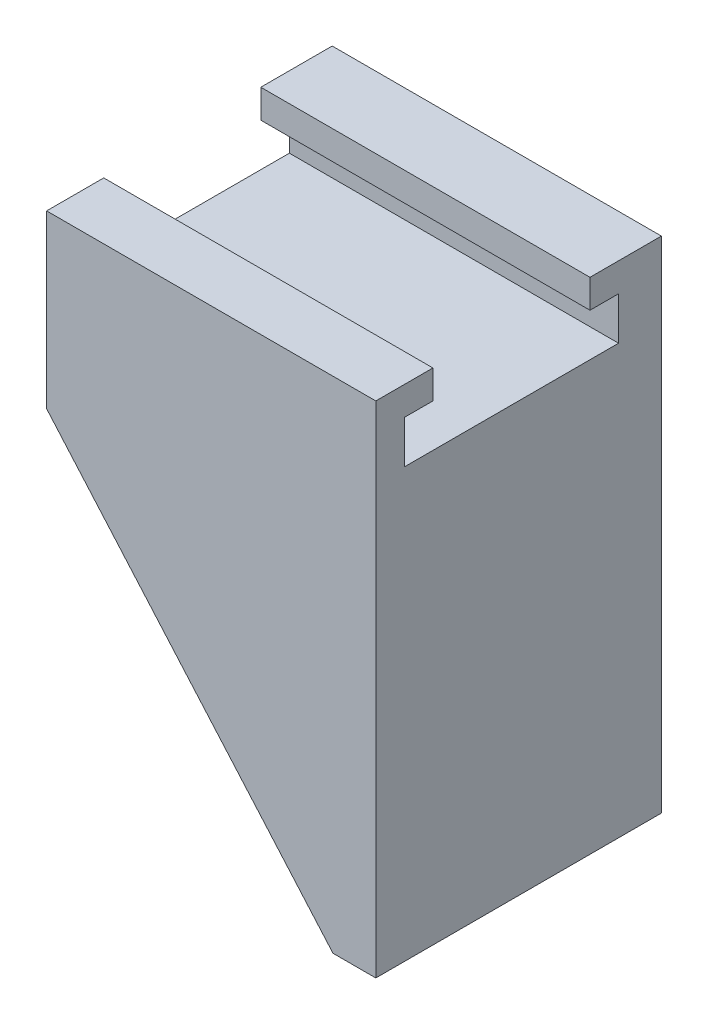
ISO-10303-21;
HEADER;
FILE_DESCRIPTION(('STEP AP214'),'2;1');
FILE_NAME('part.step','',(''),(''),'','','');
FILE_SCHEMA(('AUTOMOTIVE_DESIGN { 1 0 10303 214 1 1 1 1 }'));
ENDSEC;
DATA;
#1=APPLICATION_CONTEXT('core data for automotive mechanical design processes');
#2=APPLICATION_PROTOCOL_DEFINITION('international standard','automotive_design',2000,#1);
#3=PRODUCT_CONTEXT('',#1,'mechanical');
#4=PRODUCT('Part','Part','',(#3));
#5=PRODUCT_RELATED_PRODUCT_CATEGORY('part','',(#4));
#6=PRODUCT_DEFINITION_FORMATION('','',#4);
#7=PRODUCT_DEFINITION_CONTEXT('part definition',#1,'design');
#8=PRODUCT_DEFINITION('design','',#6,#7);
#9=PRODUCT_DEFINITION_SHAPE('','',#8);
#10=(LENGTH_UNIT() NAMED_UNIT(*) SI_UNIT(.MILLI.,.METRE.));
#11=(NAMED_UNIT(*) PLANE_ANGLE_UNIT() SI_UNIT($,.RADIAN.));
#12=(NAMED_UNIT(*) SI_UNIT($,.STERADIAN.) SOLID_ANGLE_UNIT());
#13=UNCERTAINTY_MEASURE_WITH_UNIT(LENGTH_MEASURE(1.E-05),#10,'distance_accuracy_value','');
#14=(GEOMETRIC_REPRESENTATION_CONTEXT(3) GLOBAL_UNCERTAINTY_ASSIGNED_CONTEXT((#13)) GLOBAL_UNIT_ASSIGNED_CONTEXT((#10,
#11,#12)) REPRESENTATION_CONTEXT('',''));
#15=CARTESIAN_POINT('',(0.,0.,0.));
#16=DIRECTION('',(0.,0.,1.));
#17=DIRECTION('',(1.,0.,0.));
#18=AXIS2_PLACEMENT_3D('',#15,#16,#17);
#19=CARTESIAN_POINT('',(0.,35.,20.));
#20=DIRECTION('',(0.,1.,0.));
#21=DIRECTION('',(0.,0.,1.));
#22=AXIS2_PLACEMENT_3D('',#19,#20,#21);
#23=PLANE('',#22);
#24=DIRECTION('',(0.,0.,-1.));
#25=VECTOR('',#24,1.);
#26=CARTESIAN_POINT('',(-20.0538947368421,35.,20.));
#27=LINE('',#26,#25);
#28=CARTESIAN_POINT('',(-20.0538947368421,35.,5.00000000000001));
#29=VERTEX_POINT('',#28);
#30=CARTESIAN_POINT('',(-20.0538947368421,35.,0.));
#31=VERTEX_POINT('',#30);
#32=EDGE_CURVE('E50',#29,#31,#27,.T.);
#33=ORIENTED_EDGE('',*,*,#32,.F.);
#34=DIRECTION('',(1.,0.,0.));
#35=VECTOR('',#34,1.);
#36=CARTESIAN_POINT('',(-20.0538947368421,35.,5.00000000000001));
#37=LINE('',#36,#35);
#38=CARTESIAN_POINT('',(3.,35.,5.00000000000001));
#39=VERTEX_POINT('',#38);
#40=EDGE_CURVE('E193',#29,#39,#37,.T.);
#41=ORIENTED_EDGE('',*,*,#40,.T.);
#42=DIRECTION('',(0.,0.,-1.));
#43=VECTOR('',#42,1.);
#44=CARTESIAN_POINT('',(3.,35.,20.));
#45=LINE('',#44,#43);
#46=CARTESIAN_POINT('',(3.,35.,0.));
#47=VERTEX_POINT('',#46);
#48=EDGE_CURVE('E91',#39,#47,#45,.T.);
#49=ORIENTED_EDGE('',*,*,#48,.T.);
#50=DIRECTION('',(1.,0.,0.));
#51=VECTOR('',#50,1.);
#52=CARTESIAN_POINT('',(0.,35.,0.));
#53=LINE('',#52,#51);
#54=EDGE_CURVE('E138',#31,#47,#53,.T.);
#55=ORIENTED_EDGE('',*,*,#54,.F.);
#56=EDGE_LOOP('',(#33,#41,#49,#55));
#57=FACE_BOUND('',#56,.T.);
#58=ADVANCED_FACE('F41',(#57),#23,.T.);
#59=DIRECTION('',(1.,0.,0.));
#60=VECTOR('',#59,1.);
#61=CARTESIAN_POINT('',(-20.0538947368421,35.,16.));
#62=LINE('',#61,#60);
#63=CARTESIAN_POINT('',(-20.0538947368421,35.,16.));
#64=VERTEX_POINT('',#63);
#65=CARTESIAN_POINT('',(3.,35.,16.));
#66=VERTEX_POINT('',#65);
#67=EDGE_CURVE('E183',#64,#66,#62,.T.);
#68=ORIENTED_EDGE('',*,*,#67,.F.);
#69=CARTESIAN_POINT('',(-20.0538947368421,35.,20.));
#70=VERTEX_POINT('',#69);
#71=EDGE_CURVE('E11',#70,#64,#27,.T.);
#72=ORIENTED_EDGE('',*,*,#71,.F.);
#73=DIRECTION('',(1.,0.,0.));
#74=VECTOR('',#73,1.);
#75=CARTESIAN_POINT('',(0.,35.,20.));
#76=LINE('',#75,#74);
#77=CARTESIAN_POINT('',(3.,35.,20.));
#78=VERTEX_POINT('',#77);
#79=EDGE_CURVE('E154',#70,#78,#76,.T.);
#80=ORIENTED_EDGE('',*,*,#79,.T.);
#81=EDGE_CURVE('E155',#78,#66,#45,.T.);
#82=ORIENTED_EDGE('',*,*,#81,.T.);
#83=EDGE_LOOP('',(#68,#72,#80,#82));
#84=FACE_BOUND('',#83,.T.);
#85=ADVANCED_FACE('F43',(#84),#23,.T.);
#86=CARTESIAN_POINT('',(-20.0538947368421,0.,20.));
#87=DIRECTION('',(1.,0.,0.));
#88=DIRECTION('',(0.,1.,0.));
#89=AXIS2_PLACEMENT_3D('',#86,#87,#88);
#90=PLANE('',#89);
#91=ORIENTED_EDGE('',*,*,#71,.T.);
#92=DIRECTION('',(0.,-1.,0.));
#93=VECTOR('',#92,1.);
#94=CARTESIAN_POINT('',(-20.0538947368421,0.,16.));
#95=LINE('',#94,#93);
#96=CARTESIAN_POINT('',(-20.0538947368421,33.,16.));
#97=VERTEX_POINT('',#96);
#98=EDGE_CURVE('E197',#64,#97,#95,.T.);
#99=ORIENTED_EDGE('',*,*,#98,.T.);
#100=DIRECTION('',(0.,0.,1.));
#101=VECTOR('',#100,1.);
#102=CARTESIAN_POINT('',(-20.0538947368421,33.,0.));
#103=LINE('',#102,#101);
#104=CARTESIAN_POINT('',(-20.0538947368421,33.,18.));
#105=VERTEX_POINT('',#104);
#106=EDGE_CURVE('E254',#97,#105,#103,.T.);
#107=ORIENTED_EDGE('',*,*,#106,.T.);
#108=DIRECTION('',(0.,-1.,0.));
#109=VECTOR('',#108,1.);
#110=CARTESIAN_POINT('',(-20.0538947368421,0.,18.));
#111=LINE('',#110,#109);
#112=CARTESIAN_POINT('',(-20.0538947368421,30.,18.));
#113=VERTEX_POINT('',#112);
#114=EDGE_CURVE('E206',#105,#113,#111,.T.);
#115=ORIENTED_EDGE('',*,*,#114,.T.);
#116=DIRECTION('',(0.,0.,1.));
#117=VECTOR('',#116,1.);
#118=CARTESIAN_POINT('',(-20.0538947368421,30.,0.));
#119=LINE('',#118,#117);
#120=CARTESIAN_POINT('',(-20.0538947368421,30.,3.00000000000001));
#121=VERTEX_POINT('',#120);
#122=EDGE_CURVE('E229',#121,#113,#119,.T.);
#123=ORIENTED_EDGE('',*,*,#122,.F.);
#124=DIRECTION('',(0.,-1.,0.));
#125=VECTOR('',#124,1.);
#126=CARTESIAN_POINT('',(-20.0538947368421,0.,3.));
#127=LINE('',#126,#125);
#128=CARTESIAN_POINT('',(-20.0538947368421,33.,3.00000000000001));
#129=VERTEX_POINT('',#128);
#130=EDGE_CURVE('E265',#129,#121,#127,.T.);
#131=ORIENTED_EDGE('',*,*,#130,.F.);
#132=DIRECTION('',(0.,0.,-1.));
#133=VECTOR('',#132,1.);
#134=CARTESIAN_POINT('',(-20.0538947368421,33.,0.));
#135=LINE('',#134,#133);
#136=CARTESIAN_POINT('',(-20.0538947368421,33.,5.00000000000001));
#137=VERTEX_POINT('',#136);
#138=EDGE_CURVE('E261',#137,#129,#135,.T.);
#139=ORIENTED_EDGE('',*,*,#138,.F.);
#140=DIRECTION('',(0.,-1.,0.));
#141=VECTOR('',#140,1.);
#142=CARTESIAN_POINT('',(-20.0538947368421,0.,5.00000000000001));
#143=LINE('',#142,#141);
#144=EDGE_CURVE('E170',#29,#137,#143,.T.);
#145=ORIENTED_EDGE('',*,*,#144,.F.);
#146=ORIENTED_EDGE('',*,*,#32,.T.);
#147=DIRECTION('',(0.,-1.,0.));
#148=VECTOR('',#147,1.);
#149=CARTESIAN_POINT('',(-20.0538947368421,0.,0.));
#150=LINE('',#149,#148);
#151=CARTESIAN_POINT('',(-20.0538947368421,23.,0.));
#152=VERTEX_POINT('',#151);
#153=EDGE_CURVE('E142',#31,#152,#150,.T.);
#154=ORIENTED_EDGE('',*,*,#153,.T.);
#155=DIRECTION('',(0.,0.,-1.));
#156=VECTOR('',#155,1.);
#157=CARTESIAN_POINT('',(-20.0538947368421,23.,20.));
#158=LINE('',#157,#156);
#159=CARTESIAN_POINT('',(-20.0538947368421,23.,20.));
#160=VERTEX_POINT('',#159);
#161=EDGE_CURVE('E127',#160,#152,#158,.T.);
#162=ORIENTED_EDGE('',*,*,#161,.F.);
#163=DIRECTION('',(0.,-1.,0.));
#164=VECTOR('',#163,1.);
#165=CARTESIAN_POINT('',(-20.0538947368421,0.,20.));
#166=LINE('',#165,#164);
#167=EDGE_CURVE('E113',#70,#160,#166,.T.);
#168=ORIENTED_EDGE('',*,*,#167,.F.);
#169=EDGE_LOOP('',(#91,#99,#107,#115,#123,#131,#139,#145,#146,#154,#162,#168));
#170=FACE_BOUND('',#169,.T.);
#171=ADVANCED_FACE('F166',(#170),#90,.F.);
#172=CARTESIAN_POINT('',(0.,0.,20.));
#173=DIRECTION('',(0.753730318125683,0.657183846072129,0.));
#174=DIRECTION('',(-0.657183846072129,0.753730318125683,0.));
#175=AXIS2_PLACEMENT_3D('',#172,#173,#174);
#176=PLANE('',#175);
#177=DIRECTION('',(0.657183846072129,-0.753730318125683,0.));
#178=VECTOR('',#177,1.);
#179=CARTESIAN_POINT('',(0.,0.,0.));
#180=LINE('',#179,#178);
#181=CARTESIAN_POINT('',(0.,0.,0.));
#182=VERTEX_POINT('',#181);
#183=EDGE_CURVE('E123',#152,#182,#180,.T.);
#184=ORIENTED_EDGE('',*,*,#183,.T.);
#185=DIRECTION('',(0.,0.,-1.));
#186=VECTOR('',#185,1.);
#187=CARTESIAN_POINT('',(0.,0.,20.));
#188=LINE('',#187,#186);
#189=CARTESIAN_POINT('',(0.,0.,20.));
#190=VERTEX_POINT('',#189);
#191=EDGE_CURVE('E120',#190,#182,#188,.T.);
#192=ORIENTED_EDGE('',*,*,#191,.F.);
#193=DIRECTION('',(0.657183846072129,-0.753730318125683,0.));
#194=VECTOR('',#193,1.);
#195=CARTESIAN_POINT('',(0.,0.,20.));
#196=LINE('',#195,#194);
#197=EDGE_CURVE('E107',#160,#190,#196,.T.);
#198=ORIENTED_EDGE('',*,*,#197,.F.);
#199=ORIENTED_EDGE('',*,*,#161,.T.);
#200=EDGE_LOOP('',(#184,#192,#198,#199));
#201=FACE_BOUND('',#200,.T.);
#202=ADVANCED_FACE('F121',(#201),#176,.F.);
#203=CARTESIAN_POINT('',(0.,0.,20.));
#204=DIRECTION('',(0.,1.,0.));
#205=DIRECTION('',(0.,0.,1.));
#206=AXIS2_PLACEMENT_3D('',#203,#204,#205);
#207=PLANE('',#206);
#208=DIRECTION('',(1.,0.,0.));
#209=VECTOR('',#208,1.);
#210=CARTESIAN_POINT('',(0.,0.,0.));
#211=LINE('',#210,#209);
#212=CARTESIAN_POINT('',(3.,0.,0.));
#213=VERTEX_POINT('',#212);
#214=EDGE_CURVE('E148',#182,#213,#211,.T.);
#215=ORIENTED_EDGE('',*,*,#214,.T.);
#216=DIRECTION('',(0.,0.,-1.));
#217=VECTOR('',#216,1.);
#218=CARTESIAN_POINT('',(3.,0.,20.));
#219=LINE('',#218,#217);
#220=CARTESIAN_POINT('',(3.,0.,20.));
#221=VERTEX_POINT('',#220);
#222=EDGE_CURVE('E128',#221,#213,#219,.T.);
#223=ORIENTED_EDGE('',*,*,#222,.F.);
#224=DIRECTION('',(1.,0.,0.));
#225=VECTOR('',#224,1.);
#226=CARTESIAN_POINT('',(0.,0.,20.));
#227=LINE('',#226,#225);
#228=EDGE_CURVE('E111',#190,#221,#227,.T.);
#229=ORIENTED_EDGE('',*,*,#228,.F.);
#230=ORIENTED_EDGE('',*,*,#191,.T.);
#231=EDGE_LOOP('',(#215,#223,#229,#230));
#232=FACE_BOUND('',#231,.T.);
#233=ADVANCED_FACE('F130',(#232),#207,.F.);
#234=CARTESIAN_POINT('',(3.,0.,20.));
#235=DIRECTION('',(-1.,0.,0.));
#236=DIRECTION('',(0.,0.,1.));
#237=AXIS2_PLACEMENT_3D('',#234,#235,#236);
#238=PLANE('',#237);
#239=DIRECTION('',(0.,0.,1.));
#240=VECTOR('',#239,1.);
#241=CARTESIAN_POINT('',(3.,33.,0.));
#242=LINE('',#241,#240);
#243=CARTESIAN_POINT('',(3.,33.,16.));
#244=VERTEX_POINT('',#243);
#245=CARTESIAN_POINT('',(3.,33.,18.));
#246=VERTEX_POINT('',#245);
#247=EDGE_CURVE('E230',#244,#246,#242,.T.);
#248=ORIENTED_EDGE('',*,*,#247,.F.);
#249=DIRECTION('',(0.,-1.,0.));
#250=VECTOR('',#249,1.);
#251=CARTESIAN_POINT('',(3.,0.,16.));
#252=LINE('',#251,#250);
#253=EDGE_CURVE('E234',#66,#244,#252,.T.);
#254=ORIENTED_EDGE('',*,*,#253,.F.);
#255=ORIENTED_EDGE('',*,*,#81,.F.);
#256=DIRECTION('',(0.,1.,0.));
#257=VECTOR('',#256,1.);
#258=CARTESIAN_POINT('',(3.,0.,20.));
#259=LINE('',#258,#257);
#260=EDGE_CURVE('E66',#221,#78,#259,.T.);
#261=ORIENTED_EDGE('',*,*,#260,.F.);
#262=ORIENTED_EDGE('',*,*,#222,.T.);
#263=DIRECTION('',(0.,1.,0.));
#264=VECTOR('',#263,1.);
#265=CARTESIAN_POINT('',(3.,0.,0.));
#266=LINE('',#265,#264);
#267=EDGE_CURVE('E151',#213,#47,#266,.T.);
#268=ORIENTED_EDGE('',*,*,#267,.T.);
#269=ORIENTED_EDGE('',*,*,#48,.F.);
#270=DIRECTION('',(0.,-1.,0.));
#271=VECTOR('',#270,1.);
#272=CARTESIAN_POINT('',(3.,0.,5.00000000000001));
#273=LINE('',#272,#271);
#274=CARTESIAN_POINT('',(3.,33.,5.00000000000001));
#275=VERTEX_POINT('',#274);
#276=EDGE_CURVE('E237',#39,#275,#273,.T.);
#277=ORIENTED_EDGE('',*,*,#276,.T.);
#278=DIRECTION('',(0.,0.,-1.));
#279=VECTOR('',#278,1.);
#280=CARTESIAN_POINT('',(3.,33.,0.));
#281=LINE('',#280,#279);
#282=CARTESIAN_POINT('',(3.,33.,3.00000000000001));
#283=VERTEX_POINT('',#282);
#284=EDGE_CURVE('E241',#275,#283,#281,.T.);
#285=ORIENTED_EDGE('',*,*,#284,.T.);
#286=DIRECTION('',(0.,-1.,0.));
#287=VECTOR('',#286,1.);
#288=CARTESIAN_POINT('',(3.,0.,3.));
#289=LINE('',#288,#287);
#290=CARTESIAN_POINT('',(3.,30.,3.00000000000001));
#291=VERTEX_POINT('',#290);
#292=EDGE_CURVE('E245',#283,#291,#289,.T.);
#293=ORIENTED_EDGE('',*,*,#292,.T.);
#294=DIRECTION('',(0.,0.,1.));
#295=VECTOR('',#294,1.);
#296=CARTESIAN_POINT('',(3.,30.,0.));
#297=LINE('',#296,#295);
#298=CARTESIAN_POINT('',(3.,30.,18.));
#299=VERTEX_POINT('',#298);
#300=EDGE_CURVE('E57',#291,#299,#297,.T.);
#301=ORIENTED_EDGE('',*,*,#300,.T.);
#302=DIRECTION('',(0.,-1.,0.));
#303=VECTOR('',#302,1.);
#304=CARTESIAN_POINT('',(3.,0.,18.));
#305=LINE('',#304,#303);
#306=EDGE_CURVE('E225',#246,#299,#305,.T.);
#307=ORIENTED_EDGE('',*,*,#306,.F.);
#308=EDGE_LOOP('',(#248,#254,#255,#261,#262,#268,#269,#277,#285,#293,#301,#307));
#309=FACE_BOUND('',#308,.T.);
#310=ADVANCED_FACE('F314',(#309),#238,.F.);
#311=CARTESIAN_POINT('',(0.,0.,20.));
#312=DIRECTION('',(0.,0.,1.));
#313=DIRECTION('',(1.,0.,0.));
#314=AXIS2_PLACEMENT_3D('',#311,#312,#313);
#315=PLANE('',#314);
#316=ORIENTED_EDGE('',*,*,#79,.F.);
#317=ORIENTED_EDGE('',*,*,#167,.T.);
#318=ORIENTED_EDGE('',*,*,#197,.T.);
#319=ORIENTED_EDGE('',*,*,#228,.T.);
#320=ORIENTED_EDGE('',*,*,#260,.T.);
#321=EDGE_LOOP('',(#316,#317,#318,#319,#320));
#322=FACE_BOUND('',#321,.T.);
#323=ADVANCED_FACE('F109',(#322),#315,.T.);
#324=CARTESIAN_POINT('',(0.,0.,0.));
#325=DIRECTION('',(0.,0.,1.));
#326=DIRECTION('',(1.,0.,0.));
#327=AXIS2_PLACEMENT_3D('',#324,#325,#326);
#328=PLANE('',#327);
#329=ORIENTED_EDGE('',*,*,#54,.T.);
#330=ORIENTED_EDGE('',*,*,#267,.F.);
#331=ORIENTED_EDGE('',*,*,#214,.F.);
#332=ORIENTED_EDGE('',*,*,#183,.F.);
#333=ORIENTED_EDGE('',*,*,#153,.F.);
#334=EDGE_LOOP('',(#329,#330,#331,#332,#333));
#335=FACE_BOUND('',#334,.T.);
#336=ADVANCED_FACE('F172',(#335),#328,.F.);
#337=CARTESIAN_POINT('',(-20.0538947368421,30.,0.));
#338=DIRECTION('',(0.,1.,0.));
#339=DIRECTION('',(0.,0.,1.));
#340=AXIS2_PLACEMENT_3D('',#337,#338,#339);
#341=PLANE('',#340);
#342=ORIENTED_EDGE('',*,*,#300,.F.);
#343=DIRECTION('',(1.,0.,0.));
#344=VECTOR('',#343,1.);
#345=CARTESIAN_POINT('',(-20.0538947368421,30.,3.00000000000001));
#346=LINE('',#345,#344);
#347=EDGE_CURVE('E202',#121,#291,#346,.T.);
#348=ORIENTED_EDGE('',*,*,#347,.F.);
#349=ORIENTED_EDGE('',*,*,#122,.T.);
#350=DIRECTION('',(1.,0.,0.));
#351=VECTOR('',#350,1.);
#352=CARTESIAN_POINT('',(-20.0538947368421,30.,18.));
#353=LINE('',#352,#351);
#354=EDGE_CURVE('E143',#113,#299,#353,.T.);
#355=ORIENTED_EDGE('',*,*,#354,.T.);
#356=EDGE_LOOP('',(#342,#348,#349,#355));
#357=FACE_BOUND('',#356,.T.);
#358=ADVANCED_FACE('F273',(#357),#341,.T.);
#359=CARTESIAN_POINT('',(-20.0538947368421,0.,18.));
#360=DIRECTION('',(0.,0.,1.));
#361=DIRECTION('',(1.,0.,0.));
#362=AXIS2_PLACEMENT_3D('',#359,#360,#361);
#363=PLANE('',#362);
#364=ORIENTED_EDGE('',*,*,#306,.T.);
#365=ORIENTED_EDGE('',*,*,#354,.F.);
#366=ORIENTED_EDGE('',*,*,#114,.F.);
#367=DIRECTION('',(1.,0.,0.));
#368=VECTOR('',#367,1.);
#369=CARTESIAN_POINT('',(-20.0538947368421,33.,18.));
#370=LINE('',#369,#368);
#371=EDGE_CURVE('E219',#105,#246,#370,.T.);
#372=ORIENTED_EDGE('',*,*,#371,.T.);
#373=EDGE_LOOP('',(#364,#365,#366,#372));
#374=FACE_BOUND('',#373,.T.);
#375=ADVANCED_FACE('F280',(#374),#363,.F.);
#376=CARTESIAN_POINT('',(-20.0538947368421,33.,0.));
#377=DIRECTION('',(0.,1.,0.));
#378=DIRECTION('',(0.,0.,1.));
#379=AXIS2_PLACEMENT_3D('',#376,#377,#378);
#380=PLANE('',#379);
#381=ORIENTED_EDGE('',*,*,#247,.T.);
#382=ORIENTED_EDGE('',*,*,#371,.F.);
#383=ORIENTED_EDGE('',*,*,#106,.F.);
#384=DIRECTION('',(1.,0.,0.));
#385=VECTOR('',#384,1.);
#386=CARTESIAN_POINT('',(-20.0538947368421,33.,16.));
#387=LINE('',#386,#385);
#388=EDGE_CURVE('E192',#97,#244,#387,.T.);
#389=ORIENTED_EDGE('',*,*,#388,.T.);
#390=EDGE_LOOP('',(#381,#382,#383,#389));
#391=FACE_BOUND('',#390,.T.);
#392=ADVANCED_FACE('F286',(#391),#380,.F.);
#393=CARTESIAN_POINT('',(-20.0538947368421,0.,16.));
#394=DIRECTION('',(0.,0.,1.));
#395=DIRECTION('',(1.,0.,0.));
#396=AXIS2_PLACEMENT_3D('',#393,#394,#395);
#397=PLANE('',#396);
#398=ORIENTED_EDGE('',*,*,#253,.T.);
#399=ORIENTED_EDGE('',*,*,#388,.F.);
#400=ORIENTED_EDGE('',*,*,#98,.F.);
#401=ORIENTED_EDGE('',*,*,#67,.T.);
#402=EDGE_LOOP('',(#398,#399,#400,#401));
#403=FACE_BOUND('',#402,.T.);
#404=ADVANCED_FACE('F316',(#403),#397,.F.);
#405=CARTESIAN_POINT('',(-20.0538947368421,0.,5.00000000000001));
#406=DIRECTION('',(0.,0.,1.));
#407=DIRECTION('',(1.,0.,0.));
#408=AXIS2_PLACEMENT_3D('',#405,#406,#407);
#409=PLANE('',#408);
#410=ORIENTED_EDGE('',*,*,#276,.F.);
#411=ORIENTED_EDGE('',*,*,#40,.F.);
#412=ORIENTED_EDGE('',*,*,#144,.T.);
#413=DIRECTION('',(1.,0.,0.));
#414=VECTOR('',#413,1.);
#415=CARTESIAN_POINT('',(-20.0538947368421,33.,5.00000000000001));
#416=LINE('',#415,#414);
#417=EDGE_CURVE('E210',#137,#275,#416,.T.);
#418=ORIENTED_EDGE('',*,*,#417,.T.);
#419=EDGE_LOOP('',(#410,#411,#412,#418));
#420=FACE_BOUND('',#419,.T.);
#421=ADVANCED_FACE('F310',(#420),#409,.T.);
#422=CARTESIAN_POINT('',(-20.0538947368421,33.,0.));
#423=DIRECTION('',(0.,-1.,0.));
#424=DIRECTION('',(0.,0.,-1.));
#425=AXIS2_PLACEMENT_3D('',#422,#423,#424);
#426=PLANE('',#425);
#427=ORIENTED_EDGE('',*,*,#284,.F.);
#428=ORIENTED_EDGE('',*,*,#417,.F.);
#429=ORIENTED_EDGE('',*,*,#138,.T.);
#430=DIRECTION('',(1.,0.,0.));
#431=VECTOR('',#430,1.);
#432=CARTESIAN_POINT('',(-20.0538947368421,33.,3.00000000000001));
#433=LINE('',#432,#431);
#434=EDGE_CURVE('E205',#129,#283,#433,.T.);
#435=ORIENTED_EDGE('',*,*,#434,.T.);
#436=EDGE_LOOP('',(#427,#428,#429,#435));
#437=FACE_BOUND('',#436,.T.);
#438=ADVANCED_FACE('F323',(#437),#426,.T.);
#439=CARTESIAN_POINT('',(-20.0538947368421,0.,3.));
#440=DIRECTION('',(0.,0.,1.));
#441=DIRECTION('',(0.,-1.,0.));
#442=AXIS2_PLACEMENT_3D('',#439,#440,#441);
#443=PLANE('',#442);
#444=ORIENTED_EDGE('',*,*,#292,.F.);
#445=ORIENTED_EDGE('',*,*,#434,.F.);
#446=ORIENTED_EDGE('',*,*,#130,.T.);
#447=ORIENTED_EDGE('',*,*,#347,.T.);
#448=EDGE_LOOP('',(#444,#445,#446,#447));
#449=FACE_BOUND('',#448,.T.);
#450=ADVANCED_FACE('F330',(#449),#443,.T.);
#451=CLOSED_SHELL('',(#58,#85,#171,#202,#233,#310,#323,#336,#358,#375,#392,#404,#421,#438,#450));
#452=MANIFOLD_SOLID_BREP('B2',#451);
#453=ADVANCED_BREP_SHAPE_REPRESENTATION('',(#18,#452),#14);
#454=SHAPE_DEFINITION_REPRESENTATION(#9,#453);
ENDSEC;
END-ISO-10303-21;
